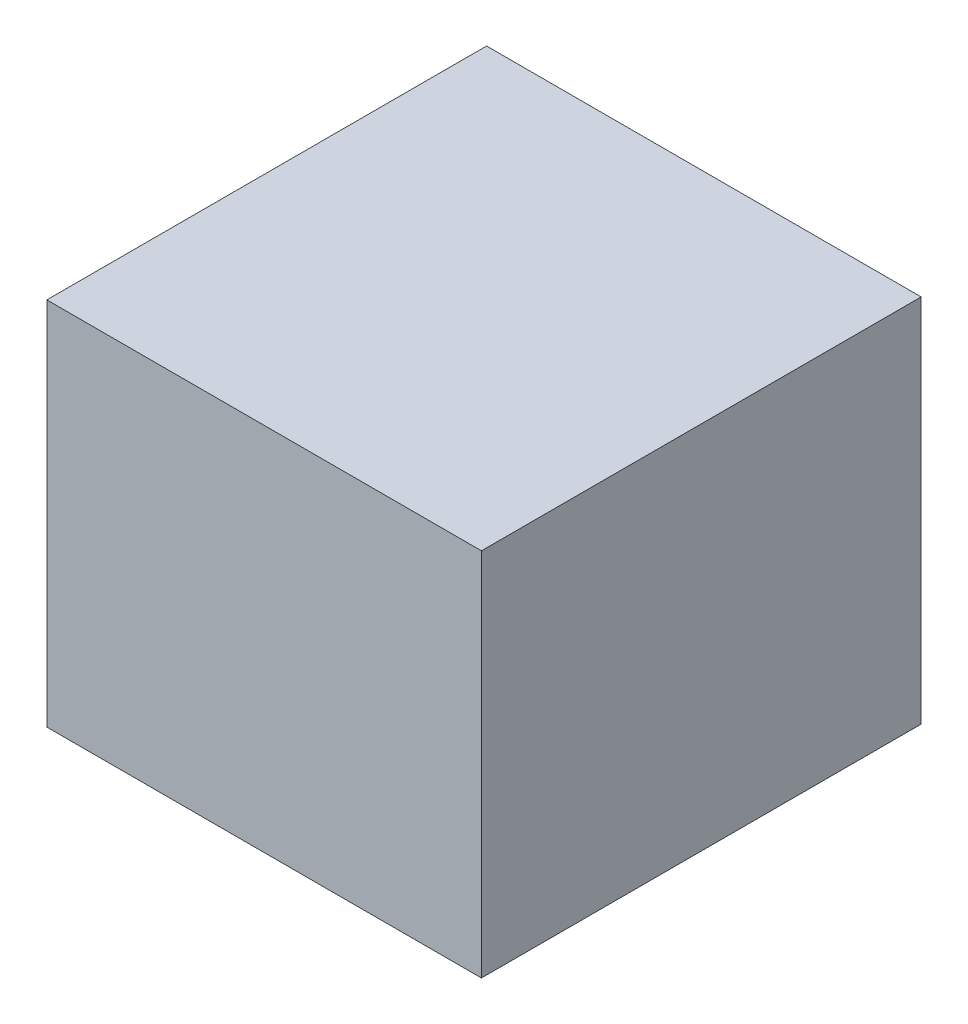
ISO-10303-21;
HEADER;
FILE_DESCRIPTION(('STEP AP214'),'2;1');
FILE_NAME('part.step','',(''),(''),'','','');
FILE_SCHEMA(('AUTOMOTIVE_DESIGN { 1 0 10303 214 1 1 1 1 }'));
ENDSEC;
DATA;
#1=APPLICATION_CONTEXT('core data for automotive mechanical design processes');
#2=APPLICATION_PROTOCOL_DEFINITION('international standard','automotive_design',2000,#1);
#3=PRODUCT_CONTEXT('',#1,'mechanical');
#4=PRODUCT('Part','Part','',(#3));
#5=PRODUCT_RELATED_PRODUCT_CATEGORY('part','',(#4));
#6=PRODUCT_DEFINITION_FORMATION('','',#4);
#7=PRODUCT_DEFINITION_CONTEXT('part definition',#1,'design');
#8=PRODUCT_DEFINITION('design','',#6,#7);
#9=PRODUCT_DEFINITION_SHAPE('','',#8);
#10=(LENGTH_UNIT() NAMED_UNIT(*) SI_UNIT(.MILLI.,.METRE.));
#11=(NAMED_UNIT(*) PLANE_ANGLE_UNIT() SI_UNIT($,.RADIAN.));
#12=(NAMED_UNIT(*) SI_UNIT($,.STERADIAN.) SOLID_ANGLE_UNIT());
#13=UNCERTAINTY_MEASURE_WITH_UNIT(LENGTH_MEASURE(1.E-05),#10,'distance_accuracy_value','');
#14=(GEOMETRIC_REPRESENTATION_CONTEXT(3) GLOBAL_UNCERTAINTY_ASSIGNED_CONTEXT((#13)) GLOBAL_UNIT_ASSIGNED_CONTEXT((#10,
#11,#12)) REPRESENTATION_CONTEXT('',''));
#15=CARTESIAN_POINT('',(0.,0.,0.));
#16=DIRECTION('',(0.,0.,1.));
#17=DIRECTION('',(1.,0.,0.));
#18=AXIS2_PLACEMENT_3D('',#15,#16,#17);
#19=CARTESIAN_POINT('',(1.270000005049E-06,1.270000012703E-06,0.5999988));
#20=DIRECTION('',(0.,0.,-1.));
#21=DIRECTION('',(0.,-1.,0.));
#22=AXIS2_PLACEMENT_3D('',#19,#20,#21);
#23=PLANE('',#22);
#24=DIRECTION('',(0.999999999990827,-4.28322393978726E-06,0.));
#25=VECTOR('',#24,1.);
#26=CARTESIAN_POINT('',(-0.29650436,0.2524125,0.5999988));
#27=LINE('',#26,#25);
#28=CARTESIAN_POINT('',(-0.29650436,0.2524125,0.5999988));
#29=VERTEX_POINT('',#28);
#30=CARTESIAN_POINT('',(0.2965069,0.25240996,0.5999988));
#31=VERTEX_POINT('',#30);
#32=EDGE_CURVE('E72',#29,#31,#27,.T.);
#33=ORIENTED_EDGE('',*,*,#32,.F.);
#34=DIRECTION('',(0.,1.,0.));
#35=VECTOR('',#34,1.);
#36=CARTESIAN_POINT('',(-0.29650436,-0.25240742,0.5999988));
#37=LINE('',#36,#35);
#38=CARTESIAN_POINT('',(-0.29650436,-0.25240742,0.5999988));
#39=VERTEX_POINT('',#38);
#40=EDGE_CURVE('E26',#39,#29,#37,.T.);
#41=ORIENTED_EDGE('',*,*,#40,.F.);
#42=DIRECTION('',(-0.999999999990827,4.28322384393126E-06,0.));
#43=VECTOR('',#42,1.);
#44=CARTESIAN_POINT('',(0.2965069,-0.25240996,0.5999988));
#45=LINE('',#44,#43);
#46=CARTESIAN_POINT('',(0.2965069,-0.25240996,0.5999988));
#47=VERTEX_POINT('',#46);
#48=EDGE_CURVE('E111',#47,#39,#45,.T.);
#49=ORIENTED_EDGE('',*,*,#48,.F.);
#50=DIRECTION('',(0.,-1.,0.));
#51=VECTOR('',#50,1.);
#52=CARTESIAN_POINT('',(0.2965069,0.25240996,0.5999988));
#53=LINE('',#52,#51);
#54=EDGE_CURVE('E74',#31,#47,#53,.T.);
#55=ORIENTED_EDGE('',*,*,#54,.F.);
#56=EDGE_LOOP('',(#33,#41,#49,#55));
#57=FACE_BOUND('',#56,.T.);
#58=ADVANCED_FACE('F16',(#57),#23,.F.);
#59=CARTESIAN_POINT('',(1.270000005049E-06,1.270000012703E-06,0.));
#60=DIRECTION('',(0.,0.,-1.));
#61=DIRECTION('',(0.,-1.,0.));
#62=AXIS2_PLACEMENT_3D('',#59,#60,#61);
#63=PLANE('',#62);
#64=DIRECTION('',(0.999999999990827,-4.28322393978726E-06,0.));
#65=VECTOR('',#64,1.);
#66=CARTESIAN_POINT('',(-0.29650436,0.2524125,0.));
#67=LINE('',#66,#65);
#68=CARTESIAN_POINT('',(-0.29650436,0.2524125,0.));
#69=VERTEX_POINT('',#68);
#70=CARTESIAN_POINT('',(0.2965069,0.25240996,0.));
#71=VERTEX_POINT('',#70);
#72=EDGE_CURVE('E83',#69,#71,#67,.T.);
#73=ORIENTED_EDGE('',*,*,#72,.T.);
#74=DIRECTION('',(0.,-1.,0.));
#75=VECTOR('',#74,1.);
#76=CARTESIAN_POINT('',(0.2965069,0.25240996,0.));
#77=LINE('',#76,#75);
#78=CARTESIAN_POINT('',(0.2965069,-0.25240996,0.));
#79=VERTEX_POINT('',#78);
#80=EDGE_CURVE('E101',#71,#79,#77,.T.);
#81=ORIENTED_EDGE('',*,*,#80,.T.);
#82=DIRECTION('',(-0.999999999990827,4.28322384393126E-06,0.));
#83=VECTOR('',#82,1.);
#84=CARTESIAN_POINT('',(0.2965069,-0.25240996,0.));
#85=LINE('',#84,#83);
#86=CARTESIAN_POINT('',(-0.29650436,-0.25240742,0.));
#87=VERTEX_POINT('',#86);
#88=EDGE_CURVE('E69',#79,#87,#85,.T.);
#89=ORIENTED_EDGE('',*,*,#88,.T.);
#90=DIRECTION('',(0.,1.,0.));
#91=VECTOR('',#90,1.);
#92=CARTESIAN_POINT('',(-0.29650436,-0.25240742,0.));
#93=LINE('',#92,#91);
#94=EDGE_CURVE('E11',#87,#69,#93,.T.);
#95=ORIENTED_EDGE('',*,*,#94,.T.);
#96=EDGE_LOOP('',(#73,#81,#89,#95));
#97=FACE_BOUND('',#96,.T.);
#98=ADVANCED_FACE('F121',(#97),#63,.T.);
#99=CARTESIAN_POINT('',(-0.29650436,-0.25240742,0.));
#100=DIRECTION('',(-1.,0.,0.));
#101=DIRECTION('',(0.,0.,1.));
#102=AXIS2_PLACEMENT_3D('',#99,#100,#101);
#103=PLANE('',#102);
#104=DIRECTION('',(0.,0.,1.));
#105=VECTOR('',#104,1.);
#106=CARTESIAN_POINT('',(-0.29650436,-0.25240742,0.));
#107=LINE('',#106,#105);
#108=EDGE_CURVE('E64',#87,#39,#107,.T.);
#109=ORIENTED_EDGE('',*,*,#108,.T.);
#110=ORIENTED_EDGE('',*,*,#40,.T.);
#111=DIRECTION('',(0.,0.,1.));
#112=VECTOR('',#111,1.);
#113=CARTESIAN_POINT('',(-0.29650436,0.2524125,0.));
#114=LINE('',#113,#112);
#115=EDGE_CURVE('E62',#69,#29,#114,.T.);
#116=ORIENTED_EDGE('',*,*,#115,.F.);
#117=ORIENTED_EDGE('',*,*,#94,.F.);
#118=EDGE_LOOP('',(#109,#110,#116,#117));
#119=FACE_BOUND('',#118,.T.);
#120=ADVANCED_FACE('F60',(#119),#103,.T.);
#121=CARTESIAN_POINT('',(0.2965069,-0.25240996,0.));
#122=DIRECTION('',(-4.28322384393126E-06,-0.999999999990827,0.));
#123=DIRECTION('',(-0.999999999990827,4.28322384393126E-06,0.));
#124=AXIS2_PLACEMENT_3D('',#121,#122,#123);
#125=PLANE('',#124);
#126=DIRECTION('',(0.,0.,1.));
#127=VECTOR('',#126,1.);
#128=CARTESIAN_POINT('',(0.2965069,-0.25240996,0.));
#129=LINE('',#128,#127);
#130=EDGE_CURVE('E93',#79,#47,#129,.T.);
#131=ORIENTED_EDGE('',*,*,#130,.T.);
#132=ORIENTED_EDGE('',*,*,#48,.T.);
#133=ORIENTED_EDGE('',*,*,#108,.F.);
#134=ORIENTED_EDGE('',*,*,#88,.F.);
#135=EDGE_LOOP('',(#131,#132,#133,#134));
#136=FACE_BOUND('',#135,.T.);
#137=ADVANCED_FACE('F124',(#136),#125,.T.);
#138=CARTESIAN_POINT('',(0.2965069,0.25240996,0.));
#139=DIRECTION('',(1.,0.,0.));
#140=DIRECTION('',(0.,1.,0.));
#141=AXIS2_PLACEMENT_3D('',#138,#139,#140);
#142=PLANE('',#141);
#143=DIRECTION('',(0.,0.,1.));
#144=VECTOR('',#143,1.);
#145=CARTESIAN_POINT('',(0.2965069,0.25240996,0.));
#146=LINE('',#145,#144);
#147=EDGE_CURVE('E79',#71,#31,#146,.T.);
#148=ORIENTED_EDGE('',*,*,#147,.T.);
#149=ORIENTED_EDGE('',*,*,#54,.T.);
#150=ORIENTED_EDGE('',*,*,#130,.F.);
#151=ORIENTED_EDGE('',*,*,#80,.F.);
#152=EDGE_LOOP('',(#148,#149,#150,#151));
#153=FACE_BOUND('',#152,.T.);
#154=ADVANCED_FACE('F18',(#153),#142,.T.);
#155=CARTESIAN_POINT('',(-0.29650436,0.2524125,0.));
#156=DIRECTION('',(4.28322393978726E-06,0.999999999990827,0.));
#157=DIRECTION('',(0.,0.,-1.));
#158=AXIS2_PLACEMENT_3D('',#155,#156,#157);
#159=PLANE('',#158);
#160=ORIENTED_EDGE('',*,*,#115,.T.);
#161=ORIENTED_EDGE('',*,*,#32,.T.);
#162=ORIENTED_EDGE('',*,*,#147,.F.);
#163=ORIENTED_EDGE('',*,*,#72,.F.);
#164=EDGE_LOOP('',(#160,#161,#162,#163));
#165=FACE_BOUND('',#164,.T.);
#166=ADVANCED_FACE('F81',(#165),#159,.T.);
#167=CLOSED_SHELL('',(#58,#98,#120,#137,#154,#166));
#168=MANIFOLD_SOLID_BREP('B1',#167);
#169=ADVANCED_BREP_SHAPE_REPRESENTATION('',(#18,#168),#14);
#170=SHAPE_DEFINITION_REPRESENTATION(#9,#169);
ENDSEC;
END-ISO-10303-21;
